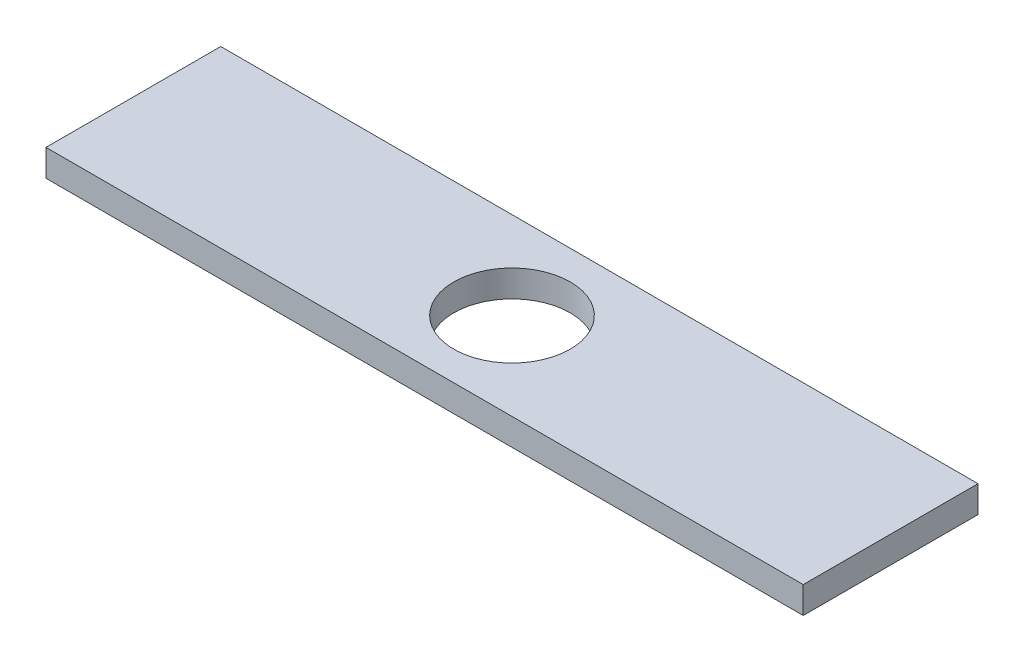
ISO-10303-21;
HEADER;
FILE_DESCRIPTION(('STEP AP214'),'2;1');
FILE_NAME('part.step','',(''),(''),'','','');
FILE_SCHEMA(('AUTOMOTIVE_DESIGN { 1 0 10303 214 1 1 1 1 }'));
ENDSEC;
DATA;
#1=APPLICATION_CONTEXT('core data for automotive mechanical design processes');
#2=APPLICATION_PROTOCOL_DEFINITION('international standard','automotive_design',2000,#1);
#3=PRODUCT_CONTEXT('',#1,'mechanical');
#4=PRODUCT('Part','Part','',(#3));
#5=PRODUCT_RELATED_PRODUCT_CATEGORY('part','',(#4));
#6=PRODUCT_DEFINITION_FORMATION('','',#4);
#7=PRODUCT_DEFINITION_CONTEXT('part definition',#1,'design');
#8=PRODUCT_DEFINITION('design','',#6,#7);
#9=PRODUCT_DEFINITION_SHAPE('','',#8);
#10=(LENGTH_UNIT() NAMED_UNIT(*) SI_UNIT(.MILLI.,.METRE.));
#11=(NAMED_UNIT(*) PLANE_ANGLE_UNIT() SI_UNIT($,.RADIAN.));
#12=(NAMED_UNIT(*) SI_UNIT($,.STERADIAN.) SOLID_ANGLE_UNIT());
#13=UNCERTAINTY_MEASURE_WITH_UNIT(LENGTH_MEASURE(1.E-05),#10,'distance_accuracy_value','');
#14=(GEOMETRIC_REPRESENTATION_CONTEXT(3) GLOBAL_UNCERTAINTY_ASSIGNED_CONTEXT((#13)) GLOBAL_UNIT_ASSIGNED_CONTEXT((#10,
#11,#12)) REPRESENTATION_CONTEXT('',''));
#15=CARTESIAN_POINT('',(0.,0.,0.));
#16=DIRECTION('',(0.,0.,1.));
#17=DIRECTION('',(1.,0.,0.));
#18=AXIS2_PLACEMENT_3D('',#15,#16,#17);
#19=CARTESIAN_POINT('',(0.,5.,0.));
#20=DIRECTION('',(0.,1.,0.));
#21=DIRECTION('',(0.,0.,1.));
#22=AXIS2_PLACEMENT_3D('',#19,#20,#21);
#23=PLANE('',#22);
#24=CARTESIAN_POINT('',(0.,5.,0.));
#25=DIRECTION('',(0.,-1.,0.));
#26=DIRECTION('',(0.,0.,-1.));
#27=AXIS2_PLACEMENT_3D('',#24,#25,#26);
#28=CIRCLE('',#27,10.);
#29=CARTESIAN_POINT('',(0.,5.,-10.));
#30=VERTEX_POINT('',#29);
#31=EDGE_CURVE('E20',#30,#30,#28,.T.);
#32=ORIENTED_EDGE('',*,*,#31,.T.);
#33=EDGE_LOOP('',(#32));
#34=FACE_BOUND('',#33,.T.);
#35=DIRECTION('',(-1.,0.,0.));
#36=VECTOR('',#35,1.);
#37=CARTESIAN_POINT('',(65.,5.,-15.));
#38=LINE('',#37,#36);
#39=CARTESIAN_POINT('',(-65.,5.,-15.));
#40=VERTEX_POINT('',#39);
#41=CARTESIAN_POINT('',(65.,5.,-15.));
#42=VERTEX_POINT('',#41);
#43=EDGE_CURVE('E70',#40,#42,#38,.F.);
#44=ORIENTED_EDGE('',*,*,#43,.F.);
#45=DIRECTION('',(0.,0.,1.));
#46=VECTOR('',#45,1.);
#47=CARTESIAN_POINT('',(-65.,5.,-15.));
#48=LINE('',#47,#46);
#49=CARTESIAN_POINT('',(-65.,5.,15.));
#50=VERTEX_POINT('',#49);
#51=EDGE_CURVE('E67',#50,#40,#48,.F.);
#52=ORIENTED_EDGE('',*,*,#51,.F.);
#53=DIRECTION('',(1.,0.,0.));
#54=VECTOR('',#53,1.);
#55=CARTESIAN_POINT('',(-65.,5.,15.));
#56=LINE('',#55,#54);
#57=CARTESIAN_POINT('',(65.,5.,15.));
#58=VERTEX_POINT('',#57);
#59=EDGE_CURVE('E58',#58,#50,#56,.F.);
#60=ORIENTED_EDGE('',*,*,#59,.F.);
#61=DIRECTION('',(0.,0.,-1.));
#62=VECTOR('',#61,1.);
#63=CARTESIAN_POINT('',(65.,5.,15.));
#64=LINE('',#63,#62);
#65=EDGE_CURVE('E53',#42,#58,#64,.F.);
#66=ORIENTED_EDGE('',*,*,#65,.F.);
#67=EDGE_LOOP('',(#44,#52,#60,#66));
#68=FACE_BOUND('',#67,.T.);
#69=ADVANCED_FACE('F17',(#34,#68),#23,.T.);
#70=CARTESIAN_POINT('',(-65.,0.,-15.));
#71=DIRECTION('',(-1.,0.,0.));
#72=DIRECTION('',(0.,0.,1.));
#73=AXIS2_PLACEMENT_3D('',#70,#71,#72);
#74=PLANE('',#73);
#75=DIRECTION('',(0.,1.,0.));
#76=VECTOR('',#75,1.);
#77=CARTESIAN_POINT('',(-65.,0.,-15.));
#78=LINE('',#77,#76);
#79=CARTESIAN_POINT('',(-65.,0.4,-15.));
#80=VERTEX_POINT('',#79);
#81=EDGE_CURVE('E82',#80,#40,#78,.T.);
#82=ORIENTED_EDGE('',*,*,#81,.F.);
#83=DIRECTION('',(0.,0.,1.));
#84=VECTOR('',#83,1.);
#85=CARTESIAN_POINT('',(-65.,0.4,-145.));
#86=LINE('',#85,#84);
#87=CARTESIAN_POINT('',(-65.,0.4,15.));
#88=VERTEX_POINT('',#87);
#89=EDGE_CURVE('E77',#80,#88,#86,.T.);
#90=ORIENTED_EDGE('',*,*,#89,.T.);
#91=DIRECTION('',(0.,1.,0.));
#92=VECTOR('',#91,1.);
#93=CARTESIAN_POINT('',(-65.,0.,15.));
#94=LINE('',#93,#92);
#95=EDGE_CURVE('E63',#50,#88,#94,.F.);
#96=ORIENTED_EDGE('',*,*,#95,.F.);
#97=ORIENTED_EDGE('',*,*,#51,.T.);
#98=EDGE_LOOP('',(#82,#90,#96,#97));
#99=FACE_BOUND('',#98,.T.);
#100=ADVANCED_FACE('F76',(#99),#74,.T.);
#101=CARTESIAN_POINT('',(-65.,0.,15.));
#102=DIRECTION('',(0.,0.,1.));
#103=DIRECTION('',(1.,0.,0.));
#104=AXIS2_PLACEMENT_3D('',#101,#102,#103);
#105=PLANE('',#104);
#106=ORIENTED_EDGE('',*,*,#95,.T.);
#107=DIRECTION('',(1.,0.,0.));
#108=VECTOR('',#107,1.);
#109=CARTESIAN_POINT('',(-142.363011818,0.4,15.));
#110=LINE('',#109,#108);
#111=CARTESIAN_POINT('',(65.,0.4,15.));
#112=VERTEX_POINT('',#111);
#113=EDGE_CURVE('E87',#88,#112,#110,.T.);
#114=ORIENTED_EDGE('',*,*,#113,.T.);
#115=DIRECTION('',(0.,1.,0.));
#116=VECTOR('',#115,1.);
#117=CARTESIAN_POINT('',(65.,0.,15.));
#118=LINE('',#117,#116);
#119=EDGE_CURVE('E65',#58,#112,#118,.F.);
#120=ORIENTED_EDGE('',*,*,#119,.F.);
#121=ORIENTED_EDGE('',*,*,#59,.T.);
#122=EDGE_LOOP('',(#106,#114,#120,#121));
#123=FACE_BOUND('',#122,.T.);
#124=ADVANCED_FACE('F60',(#123),#105,.T.);
#125=CARTESIAN_POINT('',(65.,0.,15.));
#126=DIRECTION('',(1.,0.,0.));
#127=DIRECTION('',(0.,0.,-1.));
#128=AXIS2_PLACEMENT_3D('',#125,#126,#127);
#129=PLANE('',#128);
#130=ORIENTED_EDGE('',*,*,#119,.T.);
#131=DIRECTION('',(0.,0.,1.));
#132=VECTOR('',#131,1.);
#133=CARTESIAN_POINT('',(65.,0.4,-145.));
#134=LINE('',#133,#132);
#135=CARTESIAN_POINT('',(65.,0.4,-15.));
#136=VERTEX_POINT('',#135);
#137=EDGE_CURVE('E89',#112,#136,#134,.F.);
#138=ORIENTED_EDGE('',*,*,#137,.T.);
#139=DIRECTION('',(0.,1.,0.));
#140=VECTOR('',#139,1.);
#141=CARTESIAN_POINT('',(65.,0.,-15.));
#142=LINE('',#141,#140);
#143=EDGE_CURVE('E34',#42,#136,#142,.F.);
#144=ORIENTED_EDGE('',*,*,#143,.F.);
#145=ORIENTED_EDGE('',*,*,#65,.T.);
#146=EDGE_LOOP('',(#130,#138,#144,#145));
#147=FACE_BOUND('',#146,.T.);
#148=ADVANCED_FACE('F96',(#147),#129,.T.);
#149=CARTESIAN_POINT('',(65.,0.,-15.));
#150=DIRECTION('',(0.,0.,-1.));
#151=DIRECTION('',(-1.,0.,0.));
#152=AXIS2_PLACEMENT_3D('',#149,#150,#151);
#153=PLANE('',#152);
#154=ORIENTED_EDGE('',*,*,#143,.T.);
#155=DIRECTION('',(1.,0.,0.));
#156=VECTOR('',#155,1.);
#157=CARTESIAN_POINT('',(-142.363011818,0.4,-15.));
#158=LINE('',#157,#156);
#159=EDGE_CURVE('E26',#136,#80,#158,.F.);
#160=ORIENTED_EDGE('',*,*,#159,.T.);
#161=ORIENTED_EDGE('',*,*,#81,.T.);
#162=ORIENTED_EDGE('',*,*,#43,.T.);
#163=EDGE_LOOP('',(#154,#160,#161,#162));
#164=FACE_BOUND('',#163,.T.);
#165=ADVANCED_FACE('F92',(#164),#153,.T.);
#166=CARTESIAN_POINT('',(0.,20.,0.));
#167=DIRECTION('',(0.,-1.,0.));
#168=DIRECTION('',(0.,0.,-1.));
#169=AXIS2_PLACEMENT_3D('',#166,#167,#168);
#170=CYLINDRICAL_SURFACE('',#169,10.);
#171=ORIENTED_EDGE('',*,*,#31,.F.);
#172=EDGE_LOOP('',(#171));
#173=FACE_BOUND('',#172,.T.);
#174=CARTESIAN_POINT('',(0.,0.400000000000001,0.));
#175=DIRECTION('',(0.,-1.,0.));
#176=DIRECTION('',(0.,0.,-1.));
#177=AXIS2_PLACEMENT_3D('',#174,#175,#176);
#178=CIRCLE('',#177,10.);
#179=CARTESIAN_POINT('',(0.,0.400000000000001,-10.));
#180=VERTEX_POINT('',#179);
#181=EDGE_CURVE('E11',#180,#180,#178,.T.);
#182=ORIENTED_EDGE('',*,*,#181,.T.);
#183=EDGE_LOOP('',(#182));
#184=FACE_BOUND('',#183,.T.);
#185=ADVANCED_FACE('F104',(#173,#184),#170,.F.);
#186=CARTESIAN_POINT('',(-142.363011818,0.4,-145.));
#187=DIRECTION('',(0.,1.,0.));
#188=DIRECTION('',(0.,0.,1.));
#189=AXIS2_PLACEMENT_3D('',#186,#187,#188);
#190=PLANE('',#189);
#191=ORIENTED_EDGE('',*,*,#181,.F.);
#192=EDGE_LOOP('',(#191));
#193=FACE_BOUND('',#192,.T.);
#194=ORIENTED_EDGE('',*,*,#137,.F.);
#195=ORIENTED_EDGE('',*,*,#113,.F.);
#196=ORIENTED_EDGE('',*,*,#89,.F.);
#197=ORIENTED_EDGE('',*,*,#159,.F.);
#198=EDGE_LOOP('',(#194,#195,#196,#197));
#199=FACE_BOUND('',#198,.T.);
#200=ADVANCED_FACE('F95',(#193,#199),#190,.F.);
#201=CLOSED_SHELL('',(#69,#100,#124,#148,#165,#185,#200));
#202=MANIFOLD_SOLID_BREP('B1',#201);
#203=ADVANCED_BREP_SHAPE_REPRESENTATION('',(#18,#202),#14);
#204=SHAPE_DEFINITION_REPRESENTATION(#9,#203);
ENDSEC;
END-ISO-10303-21;
